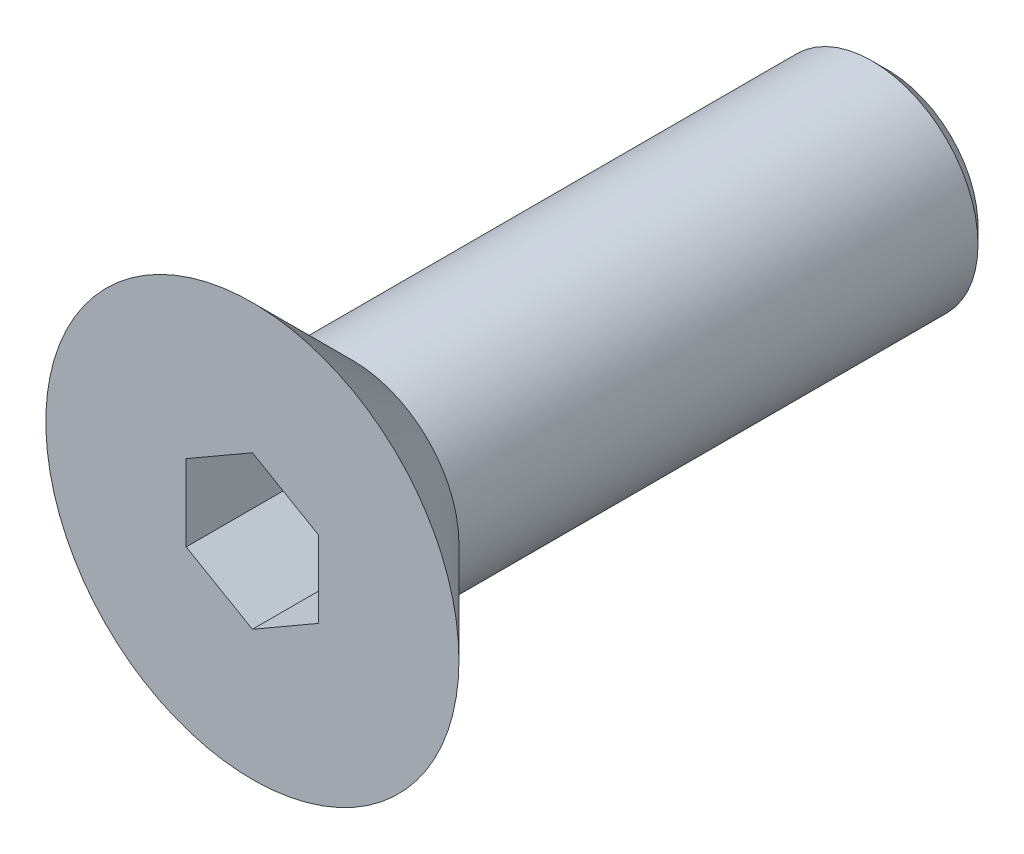
ISO-10303-21;
HEADER;
FILE_DESCRIPTION(('STEP AP214'),'2;1');
FILE_NAME('part.step','',(''),(''),'','','');
FILE_SCHEMA(('AUTOMOTIVE_DESIGN { 1 0 10303 214 1 1 1 1 }'));
ENDSEC;
DATA;
#1=APPLICATION_CONTEXT('core data for automotive mechanical design processes');
#2=APPLICATION_PROTOCOL_DEFINITION('international standard','automotive_design',2000,#1);
#3=PRODUCT_CONTEXT('',#1,'mechanical');
#4=PRODUCT('Part','Part','',(#3));
#5=PRODUCT_RELATED_PRODUCT_CATEGORY('part','',(#4));
#6=PRODUCT_DEFINITION_FORMATION('','',#4);
#7=PRODUCT_DEFINITION_CONTEXT('part definition',#1,'design');
#8=PRODUCT_DEFINITION('design','',#6,#7);
#9=PRODUCT_DEFINITION_SHAPE('','',#8);
#10=(LENGTH_UNIT() NAMED_UNIT(*) SI_UNIT(.MILLI.,.METRE.));
#11=(NAMED_UNIT(*) PLANE_ANGLE_UNIT() SI_UNIT($,.RADIAN.));
#12=(NAMED_UNIT(*) SI_UNIT($,.STERADIAN.) SOLID_ANGLE_UNIT());
#13=UNCERTAINTY_MEASURE_WITH_UNIT(LENGTH_MEASURE(1.E-05),#10,'distance_accuracy_value','');
#14=(GEOMETRIC_REPRESENTATION_CONTEXT(3) GLOBAL_UNCERTAINTY_ASSIGNED_CONTEXT((#13)) GLOBAL_UNIT_ASSIGNED_CONTEXT((#10,
#11,#12)) REPRESENTATION_CONTEXT('',''));
#15=CARTESIAN_POINT('',(0.,0.,0.));
#16=DIRECTION('',(0.,0.,1.));
#17=DIRECTION('',(1.,0.,0.));
#18=AXIS2_PLACEMENT_3D('',#15,#16,#17);
#19=CARTESIAN_POINT('',(0.,0.,2.3));
#20=DIRECTION('',(0.,0.,1.));
#21=DIRECTION('',(1.,0.,0.));
#22=AXIS2_PLACEMENT_3D('',#19,#20,#21);
#23=PLANE('',#22);
#24=CARTESIAN_POINT('',(0.,0.,2.3));
#25=DIRECTION('',(0.,0.,1.));
#26=DIRECTION('',(1.,0.,0.));
#27=AXIS2_PLACEMENT_3D('',#24,#25,#26);
#28=CIRCLE('',#27,3.89999999999996);
#29=CARTESIAN_POINT('',(3.89999999999996,0.,2.3));
#30=VERTEX_POINT('',#29);
#31=EDGE_CURVE('E42',#30,#30,#28,.T.);
#32=ORIENTED_EDGE('',*,*,#31,.T.);
#33=EDGE_LOOP('',(#32));
#34=FACE_BOUND('',#33,.T.);
#35=DIRECTION('',(-0.866025403784439,0.5,0.));
#36=VECTOR('',#35,1.);
#37=CARTESIAN_POINT('',(1.25,0.721687836487033,2.3));
#38=LINE('',#37,#36);
#39=CARTESIAN_POINT('',(1.25,0.721687836487033,2.3));
#40=VERTEX_POINT('',#39);
#41=CARTESIAN_POINT('',(0.,1.44337567297406,2.3));
#42=VERTEX_POINT('',#41);
#43=EDGE_CURVE('E49',#40,#42,#38,.T.);
#44=ORIENTED_EDGE('',*,*,#43,.F.);
#45=DIRECTION('',(0.,1.,0.));
#46=VECTOR('',#45,1.);
#47=CARTESIAN_POINT('',(1.25,-0.721687836487033,2.3));
#48=LINE('',#47,#46);
#49=CARTESIAN_POINT('',(1.25,-0.721687836487033,2.3));
#50=VERTEX_POINT('',#49);
#51=EDGE_CURVE('E132',#50,#40,#48,.T.);
#52=ORIENTED_EDGE('',*,*,#51,.F.);
#53=DIRECTION('',(0.866025403784439,0.5,0.));
#54=VECTOR('',#53,1.);
#55=CARTESIAN_POINT('',(0.,-1.44337567297406,2.3));
#56=LINE('',#55,#54);
#57=CARTESIAN_POINT('',(0.,-1.44337567297406,2.3));
#58=VERTEX_POINT('',#57);
#59=EDGE_CURVE('E130',#58,#50,#56,.T.);
#60=ORIENTED_EDGE('',*,*,#59,.F.);
#61=DIRECTION('',(0.866025403784439,-0.5,0.));
#62=VECTOR('',#61,1.);
#63=CARTESIAN_POINT('',(-1.25,-0.721687836487032,2.3));
#64=LINE('',#63,#62);
#65=CARTESIAN_POINT('',(-1.25,-0.721687836487032,2.3));
#66=VERTEX_POINT('',#65);
#67=EDGE_CURVE('E97',#66,#58,#64,.T.);
#68=ORIENTED_EDGE('',*,*,#67,.F.);
#69=DIRECTION('',(0.,-1.,0.));
#70=VECTOR('',#69,1.);
#71=CARTESIAN_POINT('',(-1.25,0.721687836487033,2.3));
#72=LINE('',#71,#70);
#73=CARTESIAN_POINT('',(-1.25,0.721687836487033,2.3));
#74=VERTEX_POINT('',#73);
#75=EDGE_CURVE('E126',#74,#66,#72,.T.);
#76=ORIENTED_EDGE('',*,*,#75,.F.);
#77=DIRECTION('',(-0.866025403784439,-0.5,0.));
#78=VECTOR('',#77,1.);
#79=CARTESIAN_POINT('',(0.,1.44337567297406,2.3));
#80=LINE('',#79,#78);
#81=EDGE_CURVE('E123',#42,#74,#80,.T.);
#82=ORIENTED_EDGE('',*,*,#81,.F.);
#83=EDGE_LOOP('',(#44,#52,#60,#68,#76,#82));
#84=FACE_BOUND('',#83,.T.);
#85=ADVANCED_FACE('F34',(#34,#84),#23,.T.);
#86=CARTESIAN_POINT('',(0.,0.,-9.7));
#87=DIRECTION('',(0.,0.,1.));
#88=DIRECTION('',(1.,0.,0.));
#89=AXIS2_PLACEMENT_3D('',#86,#87,#88);
#90=CYLINDRICAL_SURFACE('',#89,2.);
#91=CARTESIAN_POINT('',(0.,0.,0.400000000000021));
#92=DIRECTION('',(0.,0.,1.));
#93=DIRECTION('',(1.,0.,0.));
#94=AXIS2_PLACEMENT_3D('',#91,#92,#93);
#95=CIRCLE('',#94,2.);
#96=CARTESIAN_POINT('',(2.,0.,0.400000000000021));
#97=VERTEX_POINT('',#96);
#98=EDGE_CURVE('E11',#97,#97,#95,.F.);
#99=ORIENTED_EDGE('',*,*,#98,.T.);
#100=EDGE_LOOP('',(#99));
#101=FACE_BOUND('',#100,.T.);
#102=CARTESIAN_POINT('',(0.,0.,-9.4));
#103=DIRECTION('',(0.,0.,-1.));
#104=DIRECTION('',(-1.,0.,0.));
#105=AXIS2_PLACEMENT_3D('',#102,#103,#104);
#106=CIRCLE('',#105,2.);
#107=CARTESIAN_POINT('',(-2.,0.,-9.4));
#108=VERTEX_POINT('',#107);
#109=EDGE_CURVE('E144',#108,#108,#106,.F.);
#110=ORIENTED_EDGE('',*,*,#109,.T.);
#111=EDGE_LOOP('',(#110));
#112=FACE_BOUND('',#111,.T.);
#113=ADVANCED_FACE('F160',(#101,#112),#90,.T.);
#114=CARTESIAN_POINT('',(0.,0.,-9.7));
#115=DIRECTION('',(0.,0.,-1.));
#116=DIRECTION('',(-1.,0.,0.));
#117=AXIS2_PLACEMENT_3D('',#114,#115,#116);
#118=PLANE('',#117);
#119=CARTESIAN_POINT('',(0.,0.,-9.7));
#120=DIRECTION('',(0.,0.,-1.));
#121=DIRECTION('',(-1.,0.,0.));
#122=AXIS2_PLACEMENT_3D('',#119,#120,#121);
#123=CIRCLE('',#122,1.7);
#124=CARTESIAN_POINT('',(-1.7,0.,-9.7));
#125=VERTEX_POINT('',#124);
#126=EDGE_CURVE('E136',#125,#125,#123,.T.);
#127=ORIENTED_EDGE('',*,*,#126,.T.);
#128=EDGE_LOOP('',(#127));
#129=FACE_BOUND('',#128,.T.);
#130=ADVANCED_FACE('F165',(#129),#118,.T.);
#131=CARTESIAN_POINT('',(0.,0.,-9.7));
#132=DIRECTION('',(0.,0.,1.));
#133=DIRECTION('',(1.,0.,0.));
#134=AXIS2_PLACEMENT_3D('',#131,#132,#133);
#135=CONICAL_SURFACE('',#134,1.7,0.785398163397448);
#136=ORIENTED_EDGE('',*,*,#109,.F.);
#137=EDGE_LOOP('',(#136));
#138=FACE_BOUND('',#137,.T.);
#139=ORIENTED_EDGE('',*,*,#126,.F.);
#140=EDGE_LOOP('',(#139));
#141=FACE_BOUND('',#140,.T.);
#142=ADVANCED_FACE('F169',(#138,#141),#135,.T.);
#143=CARTESIAN_POINT('',(1.25,0.721687836487033,0.3));
#144=DIRECTION('',(0.5,0.866025403784439,0.));
#145=DIRECTION('',(-0.866025403784439,0.5,0.));
#146=AXIS2_PLACEMENT_3D('',#143,#144,#145);
#147=PLANE('',#146);
#148=ORIENTED_EDGE('',*,*,#43,.T.);
#149=DIRECTION('',(0.,0.,1.));
#150=VECTOR('',#149,1.);
#151=CARTESIAN_POINT('',(0.,1.44337567297406,0.3));
#152=LINE('',#151,#150);
#153=CARTESIAN_POINT('',(0.,1.44337567297406,0.3));
#154=VERTEX_POINT('',#153);
#155=EDGE_CURVE('E79',#154,#42,#152,.T.);
#156=ORIENTED_EDGE('',*,*,#155,.F.);
#157=DIRECTION('',(-0.866025403784439,0.5,0.));
#158=VECTOR('',#157,1.);
#159=CARTESIAN_POINT('',(1.25,0.721687836487033,0.3));
#160=LINE('',#159,#158);
#161=CARTESIAN_POINT('',(1.25,0.721687836487033,0.3));
#162=VERTEX_POINT('',#161);
#163=EDGE_CURVE('E134',#162,#154,#160,.T.);
#164=ORIENTED_EDGE('',*,*,#163,.F.);
#165=DIRECTION('',(0.,0.,1.));
#166=VECTOR('',#165,1.);
#167=CARTESIAN_POINT('',(1.25,0.721687836487033,0.3));
#168=LINE('',#167,#166);
#169=EDGE_CURVE('E57',#162,#40,#168,.T.);
#170=ORIENTED_EDGE('',*,*,#169,.T.);
#171=EDGE_LOOP('',(#148,#156,#164,#170));
#172=FACE_BOUND('',#171,.T.);
#173=ADVANCED_FACE('F171',(#172),#147,.F.);
#174=CARTESIAN_POINT('',(1.25,-0.721687836487033,0.3));
#175=DIRECTION('',(1.,0.,0.));
#176=DIRECTION('',(0.,1.,0.));
#177=AXIS2_PLACEMENT_3D('',#174,#175,#176);
#178=PLANE('',#177);
#179=ORIENTED_EDGE('',*,*,#51,.T.);
#180=ORIENTED_EDGE('',*,*,#169,.F.);
#181=DIRECTION('',(0.,1.,0.));
#182=VECTOR('',#181,1.);
#183=CARTESIAN_POINT('',(1.25,-0.721687836487033,0.3));
#184=LINE('',#183,#182);
#185=CARTESIAN_POINT('',(1.25,-0.721687836487033,0.3));
#186=VERTEX_POINT('',#185);
#187=EDGE_CURVE('E109',#186,#162,#184,.T.);
#188=ORIENTED_EDGE('',*,*,#187,.F.);
#189=DIRECTION('',(0.,0.,1.));
#190=VECTOR('',#189,1.);
#191=CARTESIAN_POINT('',(1.25,-0.721687836487033,0.3));
#192=LINE('',#191,#190);
#193=EDGE_CURVE('E101',#186,#50,#192,.T.);
#194=ORIENTED_EDGE('',*,*,#193,.T.);
#195=EDGE_LOOP('',(#179,#180,#188,#194));
#196=FACE_BOUND('',#195,.T.);
#197=ADVANCED_FACE('F177',(#196),#178,.F.);
#198=CARTESIAN_POINT('',(0.,-1.44337567297406,0.3));
#199=DIRECTION('',(0.5,-0.866025403784439,0.));
#200=DIRECTION('',(0.866025403784439,0.5,0.));
#201=AXIS2_PLACEMENT_3D('',#198,#199,#200);
#202=PLANE('',#201);
#203=ORIENTED_EDGE('',*,*,#59,.T.);
#204=ORIENTED_EDGE('',*,*,#193,.F.);
#205=DIRECTION('',(0.866025403784439,0.5,0.));
#206=VECTOR('',#205,1.);
#207=CARTESIAN_POINT('',(0.,-1.44337567297406,0.3));
#208=LINE('',#207,#206);
#209=CARTESIAN_POINT('',(0.,-1.44337567297406,0.3));
#210=VERTEX_POINT('',#209);
#211=EDGE_CURVE('E105',#210,#186,#208,.T.);
#212=ORIENTED_EDGE('',*,*,#211,.F.);
#213=DIRECTION('',(0.,0.,1.));
#214=VECTOR('',#213,1.);
#215=CARTESIAN_POINT('',(0.,-1.44337567297406,0.3));
#216=LINE('',#215,#214);
#217=EDGE_CURVE('E90',#210,#58,#216,.T.);
#218=ORIENTED_EDGE('',*,*,#217,.T.);
#219=EDGE_LOOP('',(#203,#204,#212,#218));
#220=FACE_BOUND('',#219,.T.);
#221=ADVANCED_FACE('F106',(#220),#202,.F.);
#222=CARTESIAN_POINT('',(-1.25,-0.721687836487032,0.3));
#223=DIRECTION('',(-0.5,-0.866025403784439,0.));
#224=DIRECTION('',(0.866025403784439,-0.5,0.));
#225=AXIS2_PLACEMENT_3D('',#222,#223,#224);
#226=PLANE('',#225);
#227=ORIENTED_EDGE('',*,*,#67,.T.);
#228=ORIENTED_EDGE('',*,*,#217,.F.);
#229=DIRECTION('',(0.866025403784439,-0.5,0.));
#230=VECTOR('',#229,1.);
#231=CARTESIAN_POINT('',(-1.25,-0.721687836487032,0.3));
#232=LINE('',#231,#230);
#233=CARTESIAN_POINT('',(-1.25,-0.721687836487032,0.3));
#234=VERTEX_POINT('',#233);
#235=EDGE_CURVE('E94',#234,#210,#232,.T.);
#236=ORIENTED_EDGE('',*,*,#235,.F.);
#237=DIRECTION('',(0.,0.,1.));
#238=VECTOR('',#237,1.);
#239=CARTESIAN_POINT('',(-1.25,-0.721687836487032,0.3));
#240=LINE('',#239,#238);
#241=EDGE_CURVE('E102',#234,#66,#240,.T.);
#242=ORIENTED_EDGE('',*,*,#241,.T.);
#243=EDGE_LOOP('',(#227,#228,#236,#242));
#244=FACE_BOUND('',#243,.T.);
#245=ADVANCED_FACE('F92',(#244),#226,.F.);
#246=CARTESIAN_POINT('',(-1.25,0.721687836487033,0.3));
#247=DIRECTION('',(-1.,0.,0.));
#248=DIRECTION('',(0.,0.,1.));
#249=AXIS2_PLACEMENT_3D('',#246,#247,#248);
#250=PLANE('',#249);
#251=ORIENTED_EDGE('',*,*,#75,.T.);
#252=ORIENTED_EDGE('',*,*,#241,.F.);
#253=DIRECTION('',(0.,-1.,0.));
#254=VECTOR('',#253,1.);
#255=CARTESIAN_POINT('',(-1.25,0.721687836487033,0.3));
#256=LINE('',#255,#254);
#257=CARTESIAN_POINT('',(-1.25,0.721687836487033,0.3));
#258=VERTEX_POINT('',#257);
#259=EDGE_CURVE('E115',#258,#234,#256,.T.);
#260=ORIENTED_EDGE('',*,*,#259,.F.);
#261=DIRECTION('',(0.,0.,1.));
#262=VECTOR('',#261,1.);
#263=CARTESIAN_POINT('',(-1.25,0.721687836487033,0.3));
#264=LINE('',#263,#262);
#265=EDGE_CURVE('E139',#258,#74,#264,.T.);
#266=ORIENTED_EDGE('',*,*,#265,.T.);
#267=EDGE_LOOP('',(#251,#252,#260,#266));
#268=FACE_BOUND('',#267,.T.);
#269=ADVANCED_FACE('F189',(#268),#250,.F.);
#270=CARTESIAN_POINT('',(0.,1.44337567297406,0.3));
#271=DIRECTION('',(-0.5,0.866025403784439,0.));
#272=DIRECTION('',(-0.866025403784439,-0.5,0.));
#273=AXIS2_PLACEMENT_3D('',#270,#271,#272);
#274=PLANE('',#273);
#275=ORIENTED_EDGE('',*,*,#81,.T.);
#276=ORIENTED_EDGE('',*,*,#265,.F.);
#277=DIRECTION('',(-0.866025403784439,-0.5,0.));
#278=VECTOR('',#277,1.);
#279=CARTESIAN_POINT('',(0.,1.44337567297406,0.3));
#280=LINE('',#279,#278);
#281=EDGE_CURVE('E117',#154,#258,#280,.T.);
#282=ORIENTED_EDGE('',*,*,#281,.F.);
#283=ORIENTED_EDGE('',*,*,#155,.T.);
#284=EDGE_LOOP('',(#275,#276,#282,#283));
#285=FACE_BOUND('',#284,.T.);
#286=ADVANCED_FACE('F156',(#285),#274,.F.);
#287=CARTESIAN_POINT('',(0.,0.,0.3));
#288=DIRECTION('',(0.,0.,1.));
#289=DIRECTION('',(1.,0.,0.));
#290=AXIS2_PLACEMENT_3D('',#287,#288,#289);
#291=PLANE('',#290);
#292=ORIENTED_EDGE('',*,*,#163,.T.);
#293=ORIENTED_EDGE('',*,*,#281,.T.);
#294=ORIENTED_EDGE('',*,*,#259,.T.);
#295=ORIENTED_EDGE('',*,*,#235,.T.);
#296=ORIENTED_EDGE('',*,*,#211,.T.);
#297=ORIENTED_EDGE('',*,*,#187,.T.);
#298=EDGE_LOOP('',(#292,#293,#294,#295,#296,#297));
#299=FACE_BOUND('',#298,.T.);
#300=ADVANCED_FACE('F112',(#299),#291,.T.);
#301=CARTESIAN_POINT('',(0.,0.,2.40000000000004));
#302=DIRECTION('',(0.,0.,1.));
#303=DIRECTION('',(1.,0.,0.));
#304=AXIS2_PLACEMENT_3D('',#301,#302,#303);
#305=CONICAL_SURFACE('',#304,4.,0.785398163397443);
#306=ORIENTED_EDGE('',*,*,#98,.F.);
#307=EDGE_LOOP('',(#306));
#308=FACE_BOUND('',#307,.T.);
#309=ORIENTED_EDGE('',*,*,#31,.F.);
#310=EDGE_LOOP('',(#309));
#311=FACE_BOUND('',#310,.T.);
#312=ADVANCED_FACE('F36',(#308,#311),#305,.T.);
#313=CLOSED_SHELL('',(#85,#113,#130,#142,#173,#197,#221,#245,#269,#286,#300,#312));
#314=MANIFOLD_SOLID_BREP('B2',#313);
#315=ADVANCED_BREP_SHAPE_REPRESENTATION('',(#18,#314),#14);
#316=SHAPE_DEFINITION_REPRESENTATION(#9,#315);
ENDSEC;
END-ISO-10303-21;
